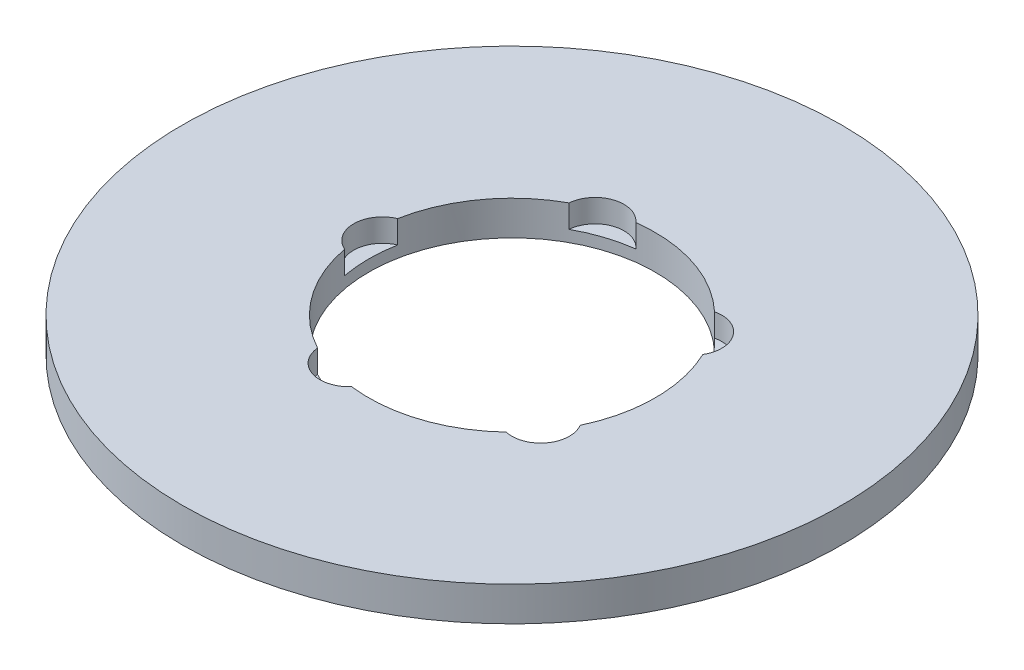
ISO-10303-21;
HEADER;
FILE_DESCRIPTION(('STEP AP214'),'2;1');
FILE_NAME('part.step','',(''),(''),'','','');
FILE_SCHEMA(('AUTOMOTIVE_DESIGN { 1 0 10303 214 1 1 1 1 }'));
ENDSEC;
DATA;
#1=APPLICATION_CONTEXT('core data for automotive mechanical design processes');
#2=APPLICATION_PROTOCOL_DEFINITION('international standard','automotive_design',2000,#1);
#3=PRODUCT_CONTEXT('',#1,'mechanical');
#4=PRODUCT('Part','Part','',(#3));
#5=PRODUCT_RELATED_PRODUCT_CATEGORY('part','',(#4));
#6=PRODUCT_DEFINITION_FORMATION('','',#4);
#7=PRODUCT_DEFINITION_CONTEXT('part definition',#1,'design');
#8=PRODUCT_DEFINITION('design','',#6,#7);
#9=PRODUCT_DEFINITION_SHAPE('','',#8);
#10=(LENGTH_UNIT() NAMED_UNIT(*) SI_UNIT(.MILLI.,.METRE.));
#11=(NAMED_UNIT(*) PLANE_ANGLE_UNIT() SI_UNIT($,.RADIAN.));
#12=(NAMED_UNIT(*) SI_UNIT($,.STERADIAN.) SOLID_ANGLE_UNIT());
#13=UNCERTAINTY_MEASURE_WITH_UNIT(LENGTH_MEASURE(1.E-05),#10,'distance_accuracy_value','');
#14=(GEOMETRIC_REPRESENTATION_CONTEXT(3) GLOBAL_UNCERTAINTY_ASSIGNED_CONTEXT((#13)) GLOBAL_UNIT_ASSIGNED_CONTEXT((#10,
#11,#12)) REPRESENTATION_CONTEXT('',''));
#15=CARTESIAN_POINT('',(0.,0.,0.));
#16=DIRECTION('',(0.,0.,1.));
#17=DIRECTION('',(1.,0.,0.));
#18=AXIS2_PLACEMENT_3D('',#15,#16,#17);
#19=CARTESIAN_POINT('',(0.,6.,0.));
#20=DIRECTION('',(0.,-1.,0.));
#21=DIRECTION('',(0.,0.,-1.));
#22=AXIS2_PLACEMENT_3D('',#19,#20,#21);
#23=CYLINDRICAL_SURFACE('',#22,57.5);
#24=CARTESIAN_POINT('',(0.,6.,0.));
#25=DIRECTION('',(0.,1.,0.));
#26=DIRECTION('',(0.,0.,1.));
#27=AXIS2_PLACEMENT_3D('',#24,#25,#26);
#28=CIRCLE('',#27,57.5);
#29=CARTESIAN_POINT('',(0.,6.,57.5));
#30=VERTEX_POINT('',#29);
#31=EDGE_CURVE('E151',#30,#30,#28,.T.);
#32=ORIENTED_EDGE('',*,*,#31,.F.);
#33=EDGE_LOOP('',(#32));
#34=FACE_BOUND('',#33,.T.);
#35=CARTESIAN_POINT('',(0.,0.,0.));
#36=DIRECTION('',(0.,1.,0.));
#37=DIRECTION('',(0.,0.,1.));
#38=AXIS2_PLACEMENT_3D('',#35,#36,#37);
#39=CIRCLE('',#38,57.5);
#40=CARTESIAN_POINT('',(0.,0.,57.5));
#41=VERTEX_POINT('',#40);
#42=EDGE_CURVE('E150',#41,#41,#39,.T.);
#43=ORIENTED_EDGE('',*,*,#42,.T.);
#44=EDGE_LOOP('',(#43));
#45=FACE_BOUND('',#44,.T.);
#46=ADVANCED_FACE('F39',(#34,#45),#23,.T.);
#47=CARTESIAN_POINT('',(0.,6.,0.));
#48=DIRECTION('',(0.,1.,0.));
#49=DIRECTION('',(0.,0.,1.));
#50=AXIS2_PLACEMENT_3D('',#47,#48,#49);
#51=PLANE('',#50);
#52=CARTESIAN_POINT('',(-6.98234601629006,6.,-21.4894513851963));
#53=DIRECTION('',(0.,1.,0.));
#54=DIRECTION('',(-0.95105651629515,0.,0.309016994374958));
#55=AXIS2_PLACEMENT_3D('',#52,#53,#54);
#56=CIRCLE('',#55,5.02787665175749);
#57=CARTESIAN_POINT('',(-3.193942890318,6.,-24.7951351844144));
#58=VERTEX_POINT('',#57);
#59=CARTESIAN_POINT('',(-11.9902607126672,6.,-21.9370382696085));
#60=VERTEX_POINT('',#59);
#61=EDGE_CURVE('E196',#58,#60,#56,.T.);
#62=ORIENTED_EDGE('',*,*,#61,.F.);
#63=CARTESIAN_POINT('',(0.,6.,0.));
#64=DIRECTION('',(0.,1.,0.));
#65=DIRECTION('',(0.,0.,1.));
#66=AXIS2_PLACEMENT_3D('',#63,#64,#65);
#67=CIRCLE('',#66,25.);
#68=CARTESIAN_POINT('',(17.158168867327,6.,-18.1823332144225));
#69=VERTEX_POINT('',#68);
#70=EDGE_CURVE('E156',#69,#58,#67,.T.);
#71=ORIENTED_EDGE('',*,*,#70,.F.);
#72=CARTESIAN_POINT('',(18.2800191918591,6.,-13.28121135564));
#73=DIRECTION('',(0.,1.,0.));
#74=DIRECTION('',(-0.58778525229248,0.,-0.809016994374942));
#75=AXIS2_PLACEMENT_3D('',#72,#73,#74);
#76=CIRCLE('',#75,5.02787665175749);
#77=CARTESIAN_POINT('',(22.5945922573853,6.,-10.6997383483197));
#78=VERTEX_POINT('',#77);
#79=EDGE_CURVE('E254',#78,#69,#76,.T.);
#80=ORIENTED_EDGE('',*,*,#79,.F.);
#81=CARTESIAN_POINT('',(22.5945922573855,6.,10.6997383483194));
#82=VERTEX_POINT('',#81);
#83=EDGE_CURVE('E153',#82,#78,#67,.T.);
#84=ORIENTED_EDGE('',*,*,#83,.F.);
#85=CARTESIAN_POINT('',(18.2800191918592,6.,13.2812113556398));
#86=DIRECTION('',(0.,1.,0.));
#87=DIRECTION('',(0.587785252292469,0.,-0.809016994374951));
#88=AXIS2_PLACEMENT_3D('',#85,#86,#87);
#89=CIRCLE('',#88,5.02787665175749);
#90=CARTESIAN_POINT('',(17.1581688673272,6.,18.1823332144223));
#91=VERTEX_POINT('',#90);
#92=EDGE_CURVE('E248',#91,#82,#89,.T.);
#93=ORIENTED_EDGE('',*,*,#92,.F.);
#94=CARTESIAN_POINT('',(-3.19394289031765,6.,24.7951351844145));
#95=VERTEX_POINT('',#94);
#96=EDGE_CURVE('E140',#95,#91,#67,.T.);
#97=ORIENTED_EDGE('',*,*,#96,.F.);
#98=CARTESIAN_POINT('',(-6.98234601628976,6.,21.4894513851964));
#99=DIRECTION('',(0.,1.,0.));
#100=DIRECTION('',(0.951056516295155,0.,0.309016994374945));
#101=AXIS2_PLACEMENT_3D('',#98,#99,#100);
#102=CIRCLE('',#101,5.02787665175749);
#103=CARTESIAN_POINT('',(-11.9902607126669,6.,21.9370382696087));
#104=VERTEX_POINT('',#103);
#105=EDGE_CURVE('E117',#104,#95,#102,.T.);
#106=ORIENTED_EDGE('',*,*,#105,.F.);
#107=CARTESIAN_POINT('',(-24.5685575217278,6.,4.62449795129702));
#108=VERTEX_POINT('',#107);
#109=EDGE_CURVE('E133',#108,#104,#67,.T.);
#110=ORIENTED_EDGE('',*,*,#109,.F.);
#111=CARTESIAN_POINT('',(-22.5953463511387,6.,0.));
#112=DIRECTION('',(0.,1.,0.));
#113=DIRECTION('',(0.,0.,1.));
#114=AXIS2_PLACEMENT_3D('',#111,#112,#113);
#115=CIRCLE('',#114,5.02787665175749);
#116=CARTESIAN_POINT('',(-24.5685575217278,6.,-4.62449795129702));
#117=VERTEX_POINT('',#116);
#118=EDGE_CURVE('E170',#117,#108,#115,.T.);
#119=ORIENTED_EDGE('',*,*,#118,.F.);
#120=EDGE_CURVE('E149',#60,#117,#67,.T.);
#121=ORIENTED_EDGE('',*,*,#120,.F.);
#122=EDGE_LOOP('',(#62,#71,#80,#84,#93,#97,#106,#110,#119,#121));
#123=FACE_BOUND('',#122,.T.);
#124=ORIENTED_EDGE('',*,*,#31,.T.);
#125=EDGE_LOOP('',(#124));
#126=FACE_BOUND('',#125,.T.);
#127=ADVANCED_FACE('F131',(#123,#126),#51,.T.);
#128=CARTESIAN_POINT('',(0.,0.,0.));
#129=DIRECTION('',(0.,1.,0.));
#130=DIRECTION('',(0.,0.,1.));
#131=AXIS2_PLACEMENT_3D('',#128,#129,#130);
#132=PLANE('',#131);
#133=CARTESIAN_POINT('',(0.,0.,0.));
#134=DIRECTION('',(0.,1.,0.));
#135=DIRECTION('',(0.,0.,1.));
#136=AXIS2_PLACEMENT_3D('',#133,#134,#135);
#137=CIRCLE('',#136,25.);
#138=CARTESIAN_POINT('',(0.,0.,25.));
#139=VERTEX_POINT('',#138);
#140=EDGE_CURVE('E160',#139,#139,#137,.T.);
#141=ORIENTED_EDGE('',*,*,#140,.T.);
#142=EDGE_LOOP('',(#141));
#143=FACE_BOUND('',#142,.T.);
#144=ORIENTED_EDGE('',*,*,#42,.F.);
#145=EDGE_LOOP('',(#144));
#146=FACE_BOUND('',#145,.T.);
#147=ADVANCED_FACE('F212',(#143,#146),#132,.F.);
#148=CARTESIAN_POINT('',(0.,6.,0.));
#149=DIRECTION('',(0.,-1.,0.));
#150=DIRECTION('',(0.,0.,-1.));
#151=AXIS2_PLACEMENT_3D('',#148,#149,#150);
#152=CYLINDRICAL_SURFACE('',#151,25.);
#153=DIRECTION('',(0.,1.,0.));
#154=VECTOR('',#153,1.);
#155=CARTESIAN_POINT('',(-3.193942890318,4.00247218322812,-24.7951351844144));
#156=LINE('',#155,#154);
#157=CARTESIAN_POINT('',(-3.193942890318,2.00494436645624,-24.7951351844144));
#158=VERTEX_POINT('',#157);
#159=EDGE_CURVE('E11',#158,#58,#156,.T.);
#160=ORIENTED_EDGE('',*,*,#159,.F.);
#161=CARTESIAN_POINT('',(0.,2.00494436645624,0.));
#162=DIRECTION('',(0.,1.,0.));
#163=DIRECTION('',(0.,0.,1.));
#164=AXIS2_PLACEMENT_3D('',#161,#162,#163);
#165=CIRCLE('',#164,25.);
#166=CARTESIAN_POINT('',(-11.9902607126672,2.00494436645624,-21.9370382696085));
#167=VERTEX_POINT('',#166);
#168=EDGE_CURVE('E193',#158,#167,#165,.T.);
#169=ORIENTED_EDGE('',*,*,#168,.T.);
#170=DIRECTION('',(0.,1.,0.));
#171=VECTOR('',#170,1.);
#172=CARTESIAN_POINT('',(-11.9902607126672,4.00247218322812,-21.9370382696085));
#173=LINE('',#172,#171);
#174=EDGE_CURVE('E46',#60,#167,#173,.F.);
#175=ORIENTED_EDGE('',*,*,#174,.F.);
#176=ORIENTED_EDGE('',*,*,#120,.T.);
#177=DIRECTION('',(0.,1.,0.));
#178=VECTOR('',#177,1.);
#179=CARTESIAN_POINT('',(-24.5685575217278,4.00247218322812,-4.62449795129702));
#180=LINE('',#179,#178);
#181=CARTESIAN_POINT('',(-24.5685575217278,2.00494436645624,-4.62449795129702));
#182=VERTEX_POINT('',#181);
#183=EDGE_CURVE('E174',#182,#117,#180,.T.);
#184=ORIENTED_EDGE('',*,*,#183,.F.);
#185=CARTESIAN_POINT('',(0.,2.00494436645624,0.));
#186=DIRECTION('',(0.,1.,0.));
#187=DIRECTION('',(0.,0.,1.));
#188=AXIS2_PLACEMENT_3D('',#185,#186,#187);
#189=CIRCLE('',#188,25.);
#190=CARTESIAN_POINT('',(-24.5685575217278,2.00494436645624,4.62449795129702));
#191=VERTEX_POINT('',#190);
#192=EDGE_CURVE('E171',#182,#191,#189,.T.);
#193=ORIENTED_EDGE('',*,*,#192,.T.);
#194=DIRECTION('',(0.,1.,0.));
#195=VECTOR('',#194,1.);
#196=CARTESIAN_POINT('',(-24.5685575217278,4.00247218322812,4.62449795129702));
#197=LINE('',#196,#195);
#198=EDGE_CURVE('E148',#108,#191,#197,.F.);
#199=ORIENTED_EDGE('',*,*,#198,.F.);
#200=ORIENTED_EDGE('',*,*,#109,.T.);
#201=DIRECTION('',(0.,1.,0.));
#202=VECTOR('',#201,1.);
#203=CARTESIAN_POINT('',(-11.9902607126669,4.00247218322812,21.9370382696087));
#204=LINE('',#203,#202);
#205=CARTESIAN_POINT('',(-11.9902607126669,2.00494436645624,21.9370382696087));
#206=VERTEX_POINT('',#205);
#207=EDGE_CURVE('E111',#206,#104,#204,.T.);
#208=ORIENTED_EDGE('',*,*,#207,.F.);
#209=CARTESIAN_POINT('',(0.,2.00494436645624,0.));
#210=DIRECTION('',(0.,1.,0.));
#211=DIRECTION('',(0.,0.,1.));
#212=AXIS2_PLACEMENT_3D('',#209,#210,#211);
#213=CIRCLE('',#212,25.);
#214=CARTESIAN_POINT('',(-3.19394289031765,2.00494436645624,24.7951351844145));
#215=VERTEX_POINT('',#214);
#216=EDGE_CURVE('E180',#206,#215,#213,.T.);
#217=ORIENTED_EDGE('',*,*,#216,.T.);
#218=DIRECTION('',(0.,1.,0.));
#219=VECTOR('',#218,1.);
#220=CARTESIAN_POINT('',(-3.19394289031765,4.00247218322812,24.7951351844145));
#221=LINE('',#220,#219);
#222=EDGE_CURVE('E124',#95,#215,#221,.F.);
#223=ORIENTED_EDGE('',*,*,#222,.F.);
#224=ORIENTED_EDGE('',*,*,#96,.T.);
#225=DIRECTION('',(0.,1.,0.));
#226=VECTOR('',#225,1.);
#227=CARTESIAN_POINT('',(17.1581688673272,4.00247218322812,18.1823332144223));
#228=LINE('',#227,#226);
#229=CARTESIAN_POINT('',(17.1581688673272,2.00494436645624,18.1823332144223));
#230=VERTEX_POINT('',#229);
#231=EDGE_CURVE('E183',#230,#91,#228,.T.);
#232=ORIENTED_EDGE('',*,*,#231,.F.);
#233=CARTESIAN_POINT('',(0.,2.00494436645624,0.));
#234=DIRECTION('',(0.,1.,0.));
#235=DIRECTION('',(0.,0.,1.));
#236=AXIS2_PLACEMENT_3D('',#233,#234,#235);
#237=CIRCLE('',#236,25.);
#238=CARTESIAN_POINT('',(22.5945922573855,2.00494436645624,10.6997383483194));
#239=VERTEX_POINT('',#238);
#240=EDGE_CURVE('E123',#230,#239,#237,.T.);
#241=ORIENTED_EDGE('',*,*,#240,.T.);
#242=DIRECTION('',(0.,1.,0.));
#243=VECTOR('',#242,1.);
#244=CARTESIAN_POINT('',(22.5945922573855,4.00247218322812,10.6997383483194));
#245=LINE('',#244,#243);
#246=EDGE_CURVE('E185',#82,#239,#245,.F.);
#247=ORIENTED_EDGE('',*,*,#246,.F.);
#248=ORIENTED_EDGE('',*,*,#83,.T.);
#249=DIRECTION('',(0.,1.,0.));
#250=VECTOR('',#249,1.);
#251=CARTESIAN_POINT('',(22.5945922573853,4.00247218322812,-10.6997383483197));
#252=LINE('',#251,#250);
#253=CARTESIAN_POINT('',(22.5945922573853,2.00494436645624,-10.6997383483197));
#254=VERTEX_POINT('',#253);
#255=EDGE_CURVE('E195',#254,#78,#252,.T.);
#256=ORIENTED_EDGE('',*,*,#255,.F.);
#257=CARTESIAN_POINT('',(0.,2.00494436645624,0.));
#258=DIRECTION('',(0.,1.,0.));
#259=DIRECTION('',(0.,0.,1.));
#260=AXIS2_PLACEMENT_3D('',#257,#258,#259);
#261=CIRCLE('',#260,25.);
#262=CARTESIAN_POINT('',(17.158168867327,2.00494436645624,-18.1823332144225));
#263=VERTEX_POINT('',#262);
#264=EDGE_CURVE('E190',#254,#263,#261,.T.);
#265=ORIENTED_EDGE('',*,*,#264,.T.);
#266=DIRECTION('',(0.,1.,0.));
#267=VECTOR('',#266,1.);
#268=CARTESIAN_POINT('',(17.158168867327,4.00247218322812,-18.1823332144225));
#269=LINE('',#268,#267);
#270=EDGE_CURVE('E189',#69,#263,#269,.F.);
#271=ORIENTED_EDGE('',*,*,#270,.F.);
#272=ORIENTED_EDGE('',*,*,#70,.T.);
#273=EDGE_LOOP('',(#160,#169,#175,#176,#184,#193,#199,#200,#208,#217,#223,#224,#232,#241,#247,
#248,#256,#265,#271,#272));
#274=FACE_BOUND('',#273,.T.);
#275=ORIENTED_EDGE('',*,*,#140,.F.);
#276=EDGE_LOOP('',(#275));
#277=FACE_BOUND('',#276,.T.);
#278=ADVANCED_FACE('F142',(#274,#277),#152,.F.);
#279=CARTESIAN_POINT('',(-22.5953463511387,2.00494436645624,0.));
#280=DIRECTION('',(0.,1.,0.));
#281=DIRECTION('',(0.,0.,1.));
#282=AXIS2_PLACEMENT_3D('',#279,#280,#281);
#283=CYLINDRICAL_SURFACE('',#282,5.02787665175749);
#284=ORIENTED_EDGE('',*,*,#183,.T.);
#285=ORIENTED_EDGE('',*,*,#118,.T.);
#286=ORIENTED_EDGE('',*,*,#198,.T.);
#287=CARTESIAN_POINT('',(-22.5953463511387,2.00494436645624,0.));
#288=DIRECTION('',(0.,1.,0.));
#289=DIRECTION('',(0.,0.,1.));
#290=AXIS2_PLACEMENT_3D('',#287,#288,#289);
#291=CIRCLE('',#290,5.02787665175749);
#292=EDGE_CURVE('E163',#182,#191,#291,.T.);
#293=ORIENTED_EDGE('',*,*,#292,.F.);
#294=EDGE_LOOP('',(#284,#285,#286,#293));
#295=FACE_BOUND('',#294,.T.);
#296=ADVANCED_FACE('F221',(#295),#283,.F.);
#297=CARTESIAN_POINT('',(-22.5953463511387,2.00494436645624,0.));
#298=DIRECTION('',(0.,1.,0.));
#299=DIRECTION('',(0.,0.,1.));
#300=AXIS2_PLACEMENT_3D('',#297,#298,#299);
#301=PLANE('',#300);
#302=ORIENTED_EDGE('',*,*,#292,.T.);
#303=ORIENTED_EDGE('',*,*,#192,.F.);
#304=EDGE_LOOP('',(#302,#303));
#305=FACE_BOUND('',#304,.T.);
#306=ADVANCED_FACE('F227',(#305),#301,.T.);
#307=CARTESIAN_POINT('',(-6.98234601628976,2.00494436645624,21.4894513851964));
#308=DIRECTION('',(0.,1.,0.));
#309=DIRECTION('',(0.,0.,1.));
#310=AXIS2_PLACEMENT_3D('',#307,#308,#309);
#311=CYLINDRICAL_SURFACE('',#310,5.02787665175749);
#312=ORIENTED_EDGE('',*,*,#207,.T.);
#313=ORIENTED_EDGE('',*,*,#105,.T.);
#314=ORIENTED_EDGE('',*,*,#222,.T.);
#315=CARTESIAN_POINT('',(-6.98234601628976,2.00494436645624,21.4894513851964));
#316=DIRECTION('',(0.,1.,0.));
#317=DIRECTION('',(0.951056516295155,0.,0.309016994374945));
#318=AXIS2_PLACEMENT_3D('',#315,#316,#317);
#319=CIRCLE('',#318,5.02787665175749);
#320=EDGE_CURVE('E119',#206,#215,#319,.T.);
#321=ORIENTED_EDGE('',*,*,#320,.F.);
#322=EDGE_LOOP('',(#312,#313,#314,#321));
#323=FACE_BOUND('',#322,.T.);
#324=ADVANCED_FACE('F116',(#323),#311,.F.);
#325=CARTESIAN_POINT('',(-6.98234601628976,2.00494436645624,21.4894513851964));
#326=DIRECTION('',(0.,1.,0.));
#327=DIRECTION('',(0.951056516295155,0.,0.309016994374945));
#328=AXIS2_PLACEMENT_3D('',#325,#326,#327);
#329=PLANE('',#328);
#330=ORIENTED_EDGE('',*,*,#320,.T.);
#331=ORIENTED_EDGE('',*,*,#216,.F.);
#332=EDGE_LOOP('',(#330,#331));
#333=FACE_BOUND('',#332,.T.);
#334=ADVANCED_FACE('F234',(#333),#329,.T.);
#335=CARTESIAN_POINT('',(18.2800191918592,2.00494436645624,13.2812113556398));
#336=DIRECTION('',(0.,1.,0.));
#337=DIRECTION('',(0.,0.,1.));
#338=AXIS2_PLACEMENT_3D('',#335,#336,#337);
#339=CYLINDRICAL_SURFACE('',#338,5.02787665175749);
#340=ORIENTED_EDGE('',*,*,#231,.T.);
#341=ORIENTED_EDGE('',*,*,#92,.T.);
#342=ORIENTED_EDGE('',*,*,#246,.T.);
#343=CARTESIAN_POINT('',(18.2800191918592,2.00494436645624,13.2812113556398));
#344=DIRECTION('',(0.,1.,0.));
#345=DIRECTION('',(0.587785252292469,0.,-0.809016994374951));
#346=AXIS2_PLACEMENT_3D('',#343,#344,#345);
#347=CIRCLE('',#346,5.02787665175749);
#348=EDGE_CURVE('E137',#230,#239,#347,.T.);
#349=ORIENTED_EDGE('',*,*,#348,.F.);
#350=EDGE_LOOP('',(#340,#341,#342,#349));
#351=FACE_BOUND('',#350,.T.);
#352=ADVANCED_FACE('F240',(#351),#339,.F.);
#353=CARTESIAN_POINT('',(18.2800191918592,2.00494436645624,13.2812113556398));
#354=DIRECTION('',(0.,1.,0.));
#355=DIRECTION('',(0.587785252292469,0.,-0.809016994374951));
#356=AXIS2_PLACEMENT_3D('',#353,#354,#355);
#357=PLANE('',#356);
#358=ORIENTED_EDGE('',*,*,#348,.T.);
#359=ORIENTED_EDGE('',*,*,#240,.F.);
#360=EDGE_LOOP('',(#358,#359));
#361=FACE_BOUND('',#360,.T.);
#362=ADVANCED_FACE('F245',(#361),#357,.T.);
#363=CARTESIAN_POINT('',(18.2800191918591,2.00494436645624,-13.28121135564));
#364=DIRECTION('',(0.,1.,0.));
#365=DIRECTION('',(0.,0.,1.));
#366=AXIS2_PLACEMENT_3D('',#363,#364,#365);
#367=CYLINDRICAL_SURFACE('',#366,5.02787665175749);
#368=ORIENTED_EDGE('',*,*,#255,.T.);
#369=ORIENTED_EDGE('',*,*,#79,.T.);
#370=ORIENTED_EDGE('',*,*,#270,.T.);
#371=CARTESIAN_POINT('',(18.2800191918591,2.00494436645624,-13.28121135564));
#372=DIRECTION('',(0.,1.,0.));
#373=DIRECTION('',(-0.58778525229248,0.,-0.809016994374942));
#374=AXIS2_PLACEMENT_3D('',#371,#372,#373);
#375=CIRCLE('',#374,5.02787665175749);
#376=EDGE_CURVE('E56',#254,#263,#375,.T.);
#377=ORIENTED_EDGE('',*,*,#376,.F.);
#378=EDGE_LOOP('',(#368,#369,#370,#377));
#379=FACE_BOUND('',#378,.T.);
#380=ADVANCED_FACE('F264',(#379),#367,.F.);
#381=CARTESIAN_POINT('',(18.2800191918591,2.00494436645624,-13.28121135564));
#382=DIRECTION('',(0.,1.,0.));
#383=DIRECTION('',(-0.58778525229248,0.,-0.809016994374942));
#384=AXIS2_PLACEMENT_3D('',#381,#382,#383);
#385=PLANE('',#384);
#386=ORIENTED_EDGE('',*,*,#376,.T.);
#387=ORIENTED_EDGE('',*,*,#264,.F.);
#388=EDGE_LOOP('',(#386,#387));
#389=FACE_BOUND('',#388,.T.);
#390=ADVANCED_FACE('F202',(#389),#385,.T.);
#391=CARTESIAN_POINT('',(-6.98234601629006,2.00494436645624,-21.4894513851963));
#392=DIRECTION('',(0.,1.,0.));
#393=DIRECTION('',(0.,0.,1.));
#394=AXIS2_PLACEMENT_3D('',#391,#392,#393);
#395=CYLINDRICAL_SURFACE('',#394,5.02787665175749);
#396=ORIENTED_EDGE('',*,*,#159,.T.);
#397=ORIENTED_EDGE('',*,*,#61,.T.);
#398=ORIENTED_EDGE('',*,*,#174,.T.);
#399=CARTESIAN_POINT('',(-6.98234601629006,2.00494436645624,-21.4894513851963));
#400=DIRECTION('',(0.,1.,0.));
#401=DIRECTION('',(-0.95105651629515,0.,0.309016994374958));
#402=AXIS2_PLACEMENT_3D('',#399,#400,#401);
#403=CIRCLE('',#402,5.02787665175749);
#404=EDGE_CURVE('E55',#158,#167,#403,.T.);
#405=ORIENTED_EDGE('',*,*,#404,.F.);
#406=EDGE_LOOP('',(#396,#397,#398,#405));
#407=FACE_BOUND('',#406,.T.);
#408=ADVANCED_FACE('F197',(#407),#395,.F.);
#409=CARTESIAN_POINT('',(-6.98234601629006,2.00494436645624,-21.4894513851963));
#410=DIRECTION('',(0.,1.,0.));
#411=DIRECTION('',(-0.95105651629515,0.,0.309016994374958));
#412=AXIS2_PLACEMENT_3D('',#409,#410,#411);
#413=PLANE('',#412);
#414=ORIENTED_EDGE('',*,*,#404,.T.);
#415=ORIENTED_EDGE('',*,*,#168,.F.);
#416=EDGE_LOOP('',(#414,#415));
#417=FACE_BOUND('',#416,.T.);
#418=ADVANCED_FACE('F200',(#417),#413,.T.);
#419=CLOSED_SHELL('',(#46,#127,#147,#278,#296,#306,#324,#334,#352,#362,#380,#390,#408,#418));
#420=MANIFOLD_SOLID_BREP('B2',#419);
#421=ADVANCED_BREP_SHAPE_REPRESENTATION('',(#18,#420),#14);
#422=SHAPE_DEFINITION_REPRESENTATION(#9,#421);
ENDSEC;
END-ISO-10303-21;
